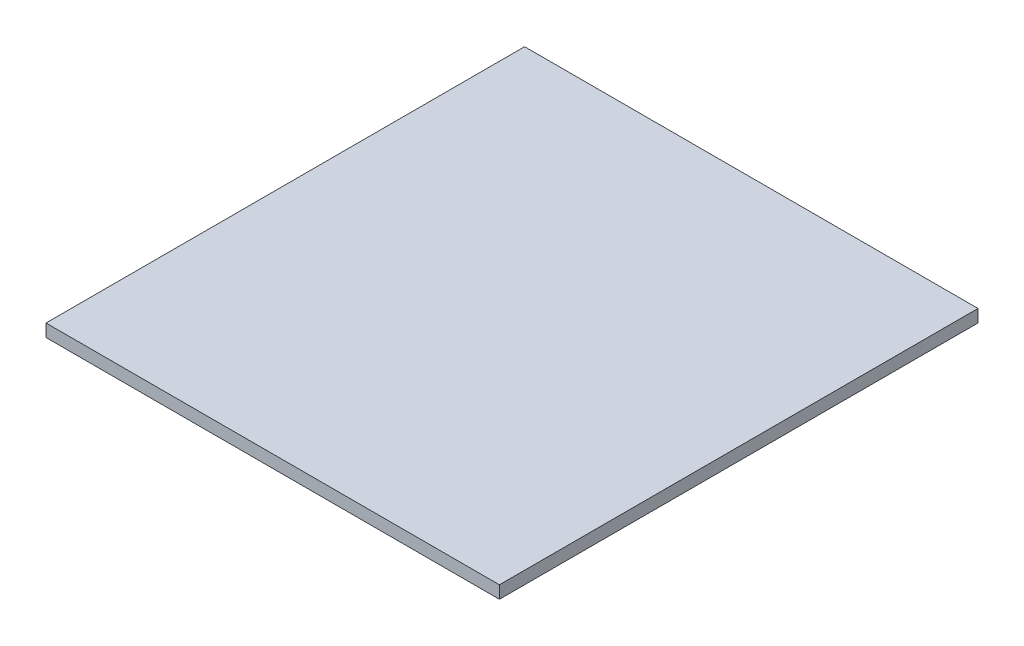
ISO-10303-21;
HEADER;
FILE_DESCRIPTION(('STEP AP214'),'2;1');
FILE_NAME('part.step','',(''),(''),'','','');
FILE_SCHEMA(('AUTOMOTIVE_DESIGN { 1 0 10303 214 1 1 1 1 }'));
ENDSEC;
DATA;
#1=APPLICATION_CONTEXT('core data for automotive mechanical design processes');
#2=APPLICATION_PROTOCOL_DEFINITION('international standard','automotive_design',2000,#1);
#3=PRODUCT_CONTEXT('',#1,'mechanical');
#4=PRODUCT('Part','Part','',(#3));
#5=PRODUCT_RELATED_PRODUCT_CATEGORY('part','',(#4));
#6=PRODUCT_DEFINITION_FORMATION('','',#4);
#7=PRODUCT_DEFINITION_CONTEXT('part definition',#1,'design');
#8=PRODUCT_DEFINITION('design','',#6,#7);
#9=PRODUCT_DEFINITION_SHAPE('','',#8);
#10=(LENGTH_UNIT() NAMED_UNIT(*) SI_UNIT(.MILLI.,.METRE.));
#11=(NAMED_UNIT(*) PLANE_ANGLE_UNIT() SI_UNIT($,.RADIAN.));
#12=(NAMED_UNIT(*) SI_UNIT($,.STERADIAN.) SOLID_ANGLE_UNIT());
#13=UNCERTAINTY_MEASURE_WITH_UNIT(LENGTH_MEASURE(1.E-05),#10,'distance_accuracy_value','');
#14=(GEOMETRIC_REPRESENTATION_CONTEXT(3) GLOBAL_UNCERTAINTY_ASSIGNED_CONTEXT((#13)) GLOBAL_UNIT_ASSIGNED_CONTEXT((#10,
#11,#12)) REPRESENTATION_CONTEXT('',''));
#15=CARTESIAN_POINT('',(0.,0.,0.));
#16=DIRECTION('',(0.,0.,1.));
#17=DIRECTION('',(1.,0.,0.));
#18=AXIS2_PLACEMENT_3D('',#15,#16,#17);
#19=CARTESIAN_POINT('',(228.6,12.7,241.3));
#20=DIRECTION('',(-1.,0.,0.));
#21=DIRECTION('',(0.,0.,1.));
#22=AXIS2_PLACEMENT_3D('',#19,#20,#21);
#23=PLANE('',#22);
#24=DIRECTION('',(0.,0.,-1.));
#25=VECTOR('',#24,1.);
#26=CARTESIAN_POINT('',(228.6,0.,241.3));
#27=LINE('',#26,#25);
#28=CARTESIAN_POINT('',(228.6,0.,241.3));
#29=VERTEX_POINT('',#28);
#30=CARTESIAN_POINT('',(228.6,0.,-241.3));
#31=VERTEX_POINT('',#30);
#32=EDGE_CURVE('E96',#29,#31,#27,.T.);
#33=ORIENTED_EDGE('',*,*,#32,.T.);
#34=DIRECTION('',(0.,-1.,0.));
#35=VECTOR('',#34,1.);
#36=CARTESIAN_POINT('',(228.6,12.7,-241.3));
#37=LINE('',#36,#35);
#38=CARTESIAN_POINT('',(228.6,12.7,-241.3));
#39=VERTEX_POINT('',#38);
#40=EDGE_CURVE('E11',#39,#31,#37,.T.);
#41=ORIENTED_EDGE('',*,*,#40,.F.);
#42=DIRECTION('',(0.,0.,-1.));
#43=VECTOR('',#42,1.);
#44=CARTESIAN_POINT('',(228.6,12.7,241.3));
#45=LINE('',#44,#43);
#46=CARTESIAN_POINT('',(228.6,12.7,241.3));
#47=VERTEX_POINT('',#46);
#48=EDGE_CURVE('E84',#47,#39,#45,.T.);
#49=ORIENTED_EDGE('',*,*,#48,.F.);
#50=DIRECTION('',(0.,-1.,0.));
#51=VECTOR('',#50,1.);
#52=CARTESIAN_POINT('',(228.6,12.7,241.3));
#53=LINE('',#52,#51);
#54=EDGE_CURVE('E92',#47,#29,#53,.T.);
#55=ORIENTED_EDGE('',*,*,#54,.T.);
#56=EDGE_LOOP('',(#33,#41,#49,#55));
#57=FACE_BOUND('',#56,.T.);
#58=ADVANCED_FACE('F33',(#57),#23,.F.);
#59=CARTESIAN_POINT('',(-228.6,12.7,-241.3));
#60=DIRECTION('',(0.,0.,1.));
#61=DIRECTION('',(1.,0.,0.));
#62=AXIS2_PLACEMENT_3D('',#59,#60,#61);
#63=PLANE('',#62);
#64=DIRECTION('',(-1.,0.,0.));
#65=VECTOR('',#64,1.);
#66=CARTESIAN_POINT('',(-228.6,0.,-241.3));
#67=LINE('',#66,#65);
#68=CARTESIAN_POINT('',(-228.6,0.,-241.3));
#69=VERTEX_POINT('',#68);
#70=EDGE_CURVE('E88',#31,#69,#67,.T.);
#71=ORIENTED_EDGE('',*,*,#70,.T.);
#72=DIRECTION('',(0.,-1.,0.));
#73=VECTOR('',#72,1.);
#74=CARTESIAN_POINT('',(-228.6,12.7,-241.3));
#75=LINE('',#74,#73);
#76=CARTESIAN_POINT('',(-228.6,12.7,-241.3));
#77=VERTEX_POINT('',#76);
#78=EDGE_CURVE('E41',#77,#69,#75,.T.);
#79=ORIENTED_EDGE('',*,*,#78,.F.);
#80=DIRECTION('',(-1.,0.,0.));
#81=VECTOR('',#80,1.);
#82=CARTESIAN_POINT('',(-228.6,12.7,-241.3));
#83=LINE('',#82,#81);
#84=EDGE_CURVE('E79',#39,#77,#83,.T.);
#85=ORIENTED_EDGE('',*,*,#84,.F.);
#86=ORIENTED_EDGE('',*,*,#40,.T.);
#87=EDGE_LOOP('',(#71,#79,#85,#86));
#88=FACE_BOUND('',#87,.T.);
#89=ADVANCED_FACE('F87',(#88),#63,.F.);
#90=CARTESIAN_POINT('',(-228.6,12.7,241.3));
#91=DIRECTION('',(1.,0.,0.));
#92=DIRECTION('',(0.,0.,-1.));
#93=AXIS2_PLACEMENT_3D('',#90,#91,#92);
#94=PLANE('',#93);
#95=DIRECTION('',(0.,0.,1.));
#96=VECTOR('',#95,1.);
#97=CARTESIAN_POINT('',(-228.6,0.,241.3));
#98=LINE('',#97,#96);
#99=CARTESIAN_POINT('',(-228.6,0.,241.3));
#100=VERTEX_POINT('',#99);
#101=EDGE_CURVE('E66',#69,#100,#98,.T.);
#102=ORIENTED_EDGE('',*,*,#101,.T.);
#103=DIRECTION('',(0.,-1.,0.));
#104=VECTOR('',#103,1.);
#105=CARTESIAN_POINT('',(-228.6,12.7,241.3));
#106=LINE('',#105,#104);
#107=CARTESIAN_POINT('',(-228.6,12.7,241.3));
#108=VERTEX_POINT('',#107);
#109=EDGE_CURVE('E89',#108,#100,#106,.T.);
#110=ORIENTED_EDGE('',*,*,#109,.F.);
#111=DIRECTION('',(0.,0.,1.));
#112=VECTOR('',#111,1.);
#113=CARTESIAN_POINT('',(-228.6,12.7,241.3));
#114=LINE('',#113,#112);
#115=EDGE_CURVE('E82',#77,#108,#114,.T.);
#116=ORIENTED_EDGE('',*,*,#115,.F.);
#117=ORIENTED_EDGE('',*,*,#78,.T.);
#118=EDGE_LOOP('',(#102,#110,#116,#117));
#119=FACE_BOUND('',#118,.T.);
#120=ADVANCED_FACE('F90',(#119),#94,.F.);
#121=CARTESIAN_POINT('',(-228.6,12.7,241.3));
#122=DIRECTION('',(0.,0.,-1.));
#123=DIRECTION('',(-1.,0.,0.));
#124=AXIS2_PLACEMENT_3D('',#121,#122,#123);
#125=PLANE('',#124);
#126=DIRECTION('',(1.,0.,0.));
#127=VECTOR('',#126,1.);
#128=CARTESIAN_POINT('',(-228.6,0.,241.3));
#129=LINE('',#128,#127);
#130=EDGE_CURVE('E72',#100,#29,#129,.T.);
#131=ORIENTED_EDGE('',*,*,#130,.T.);
#132=ORIENTED_EDGE('',*,*,#54,.F.);
#133=DIRECTION('',(1.,0.,0.));
#134=VECTOR('',#133,1.);
#135=CARTESIAN_POINT('',(-228.6,12.7,241.3));
#136=LINE('',#135,#134);
#137=EDGE_CURVE('E49',#108,#47,#136,.T.);
#138=ORIENTED_EDGE('',*,*,#137,.F.);
#139=ORIENTED_EDGE('',*,*,#109,.T.);
#140=EDGE_LOOP('',(#131,#132,#138,#139));
#141=FACE_BOUND('',#140,.T.);
#142=ADVANCED_FACE('F103',(#141),#125,.F.);
#143=CARTESIAN_POINT('',(0.,12.7,0.));
#144=DIRECTION('',(0.,-1.,0.));
#145=DIRECTION('',(0.,0.,-1.));
#146=AXIS2_PLACEMENT_3D('',#143,#144,#145);
#147=PLANE('',#146);
#148=ORIENTED_EDGE('',*,*,#48,.T.);
#149=ORIENTED_EDGE('',*,*,#84,.T.);
#150=ORIENTED_EDGE('',*,*,#115,.T.);
#151=ORIENTED_EDGE('',*,*,#137,.T.);
#152=EDGE_LOOP('',(#148,#149,#150,#151));
#153=FACE_BOUND('',#152,.T.);
#154=ADVANCED_FACE('F80',(#153),#147,.F.);
#155=CARTESIAN_POINT('',(0.,0.,0.));
#156=DIRECTION('',(0.,-1.,0.));
#157=DIRECTION('',(0.,0.,-1.));
#158=AXIS2_PLACEMENT_3D('',#155,#156,#157);
#159=PLANE('',#158);
#160=ORIENTED_EDGE('',*,*,#32,.F.);
#161=ORIENTED_EDGE('',*,*,#130,.F.);
#162=ORIENTED_EDGE('',*,*,#101,.F.);
#163=ORIENTED_EDGE('',*,*,#70,.F.);
#164=EDGE_LOOP('',(#160,#161,#162,#163));
#165=FACE_BOUND('',#164,.T.);
#166=ADVANCED_FACE('F106',(#165),#159,.T.);
#167=CLOSED_SHELL('',(#58,#89,#120,#142,#154,#166));
#168=MANIFOLD_SOLID_BREP('B2',#167);
#169=ADVANCED_BREP_SHAPE_REPRESENTATION('',(#18,#168),#14);
#170=SHAPE_DEFINITION_REPRESENTATION(#9,#169);
ENDSEC;
END-ISO-10303-21;
